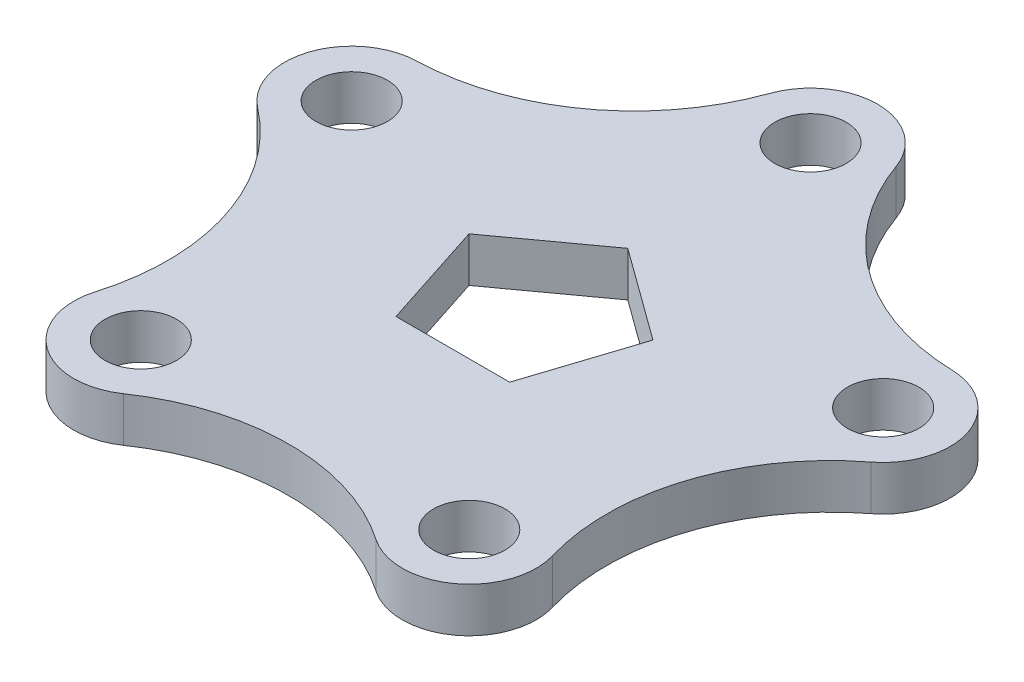
ISO-10303-21;
HEADER;
FILE_DESCRIPTION(('STEP AP214'),'2;1');
FILE_NAME('part.step','',(''),(''),'','','');
FILE_SCHEMA(('AUTOMOTIVE_DESIGN { 1 0 10303 214 1 1 1 1 }'));
ENDSEC;
DATA;
#1=APPLICATION_CONTEXT('core data for automotive mechanical design processes');
#2=APPLICATION_PROTOCOL_DEFINITION('international standard','automotive_design',2000,#1);
#3=PRODUCT_CONTEXT('',#1,'mechanical');
#4=PRODUCT('Part','Part','',(#3));
#5=PRODUCT_RELATED_PRODUCT_CATEGORY('part','',(#4));
#6=PRODUCT_DEFINITION_FORMATION('','',#4);
#7=PRODUCT_DEFINITION_CONTEXT('part definition',#1,'design');
#8=PRODUCT_DEFINITION('design','',#6,#7);
#9=PRODUCT_DEFINITION_SHAPE('','',#8);
#10=(LENGTH_UNIT() NAMED_UNIT(*) SI_UNIT(.MILLI.,.METRE.));
#11=(NAMED_UNIT(*) PLANE_ANGLE_UNIT() SI_UNIT($,.RADIAN.));
#12=(NAMED_UNIT(*) SI_UNIT($,.STERADIAN.) SOLID_ANGLE_UNIT());
#13=UNCERTAINTY_MEASURE_WITH_UNIT(LENGTH_MEASURE(1.E-05),#10,'distance_accuracy_value','');
#14=(GEOMETRIC_REPRESENTATION_CONTEXT(3) GLOBAL_UNCERTAINTY_ASSIGNED_CONTEXT((#13)) GLOBAL_UNIT_ASSIGNED_CONTEXT((#10,
#11,#12)) REPRESENTATION_CONTEXT('',''));
#15=CARTESIAN_POINT('',(0.,0.,0.));
#16=DIRECTION('',(0.,0.,1.));
#17=DIRECTION('',(1.,0.,0.));
#18=AXIS2_PLACEMENT_3D('',#15,#16,#17);
#19=CARTESIAN_POINT('',(10.2862419151183,10.,-14.1577974015616));
#20=DIRECTION('',(-0.587785252292472,0.,0.809016994374948));
#21=DIRECTION('',(0.809016994374948,0.,0.587785252292472));
#22=AXIS2_PLACEMENT_3D('',#19,#20,#21);
#23=PLANE('',#22);
#24=DIRECTION('',(-0.809016994374948,0.,-0.587785252292472));
#25=VECTOR('',#24,1.);
#26=CARTESIAN_POINT('',(10.2862419151183,0.,-14.1577974015616));
#27=LINE('',#26,#25);
#28=CARTESIAN_POINT('',(20.5724838302366,0.,-6.68440519687687));
#29=VERTEX_POINT('',#28);
#30=CARTESIAN_POINT('',(0.,0.,-21.6311896062463));
#31=VERTEX_POINT('',#30);
#32=EDGE_CURVE('E229',#29,#31,#27,.T.);
#33=ORIENTED_EDGE('',*,*,#32,.F.);
#34=DIRECTION('',(0.,-1.,0.));
#35=VECTOR('',#34,1.);
#36=CARTESIAN_POINT('',(20.5724838302366,10.,-6.68440519687687));
#37=LINE('',#36,#35);
#38=CARTESIAN_POINT('',(20.5724838302366,10.,-6.68440519687687));
#39=VERTEX_POINT('',#38);
#40=EDGE_CURVE('E11',#39,#29,#37,.T.);
#41=ORIENTED_EDGE('',*,*,#40,.F.);
#42=DIRECTION('',(-0.809016994374948,0.,-0.587785252292472));
#43=VECTOR('',#42,1.);
#44=CARTESIAN_POINT('',(10.2862419151183,10.,-14.1577974015616));
#45=LINE('',#44,#43);
#46=CARTESIAN_POINT('',(0.,10.,-21.6311896062463));
#47=VERTEX_POINT('',#46);
#48=EDGE_CURVE('E330',#39,#47,#45,.T.);
#49=ORIENTED_EDGE('',*,*,#48,.T.);
#50=DIRECTION('',(0.,-1.,0.));
#51=VECTOR('',#50,1.);
#52=CARTESIAN_POINT('',(0.,10.,-21.6311896062463));
#53=LINE('',#52,#51);
#54=EDGE_CURVE('E62',#47,#31,#53,.T.);
#55=ORIENTED_EDGE('',*,*,#54,.T.);
#56=EDGE_LOOP('',(#33,#41,#49,#55));
#57=FACE_BOUND('',#56,.T.);
#58=ADVANCED_FACE('F43',(#57),#23,.T.);
#59=CARTESIAN_POINT('',(16.6434890351652,10.,5.40779740156156));
#60=DIRECTION('',(-0.951056516295154,0.,-0.309016994374947));
#61=DIRECTION('',(-0.309016994374947,0.,0.951056516295154));
#62=AXIS2_PLACEMENT_3D('',#59,#60,#61);
#63=PLANE('',#62);
#64=DIRECTION('',(0.309016994374947,0.,-0.951056516295154));
#65=VECTOR('',#64,1.);
#66=CARTESIAN_POINT('',(16.6434890351652,0.,5.40779740156156));
#67=LINE('',#66,#65);
#68=CARTESIAN_POINT('',(12.7144942400938,0.,17.5));
#69=VERTEX_POINT('',#68);
#70=EDGE_CURVE('E231',#69,#29,#67,.T.);
#71=ORIENTED_EDGE('',*,*,#70,.F.);
#72=DIRECTION('',(0.,-1.,0.));
#73=VECTOR('',#72,1.);
#74=CARTESIAN_POINT('',(12.7144942400938,10.,17.5));
#75=LINE('',#74,#73);
#76=CARTESIAN_POINT('',(12.7144942400938,10.,17.5));
#77=VERTEX_POINT('',#76);
#78=EDGE_CURVE('E53',#77,#69,#75,.T.);
#79=ORIENTED_EDGE('',*,*,#78,.F.);
#80=DIRECTION('',(0.309016994374947,0.,-0.951056516295154));
#81=VECTOR('',#80,1.);
#82=CARTESIAN_POINT('',(16.6434890351652,10.,5.40779740156156));
#83=LINE('',#82,#81);
#84=EDGE_CURVE('E175',#77,#39,#83,.T.);
#85=ORIENTED_EDGE('',*,*,#84,.T.);
#86=ORIENTED_EDGE('',*,*,#40,.T.);
#87=EDGE_LOOP('',(#71,#79,#85,#86));
#88=FACE_BOUND('',#87,.T.);
#89=ADVANCED_FACE('F333',(#88),#63,.T.);
#90=CARTESIAN_POINT('',(0.,10.,17.5));
#91=DIRECTION('',(0.,0.,-1.));
#92=DIRECTION('',(-1.,0.,0.));
#93=AXIS2_PLACEMENT_3D('',#90,#91,#92);
#94=PLANE('',#93);
#95=DIRECTION('',(1.,0.,0.));
#96=VECTOR('',#95,1.);
#97=CARTESIAN_POINT('',(0.,0.,17.5));
#98=LINE('',#97,#96);
#99=CARTESIAN_POINT('',(-12.7144942400938,0.,17.5));
#100=VERTEX_POINT('',#99);
#101=EDGE_CURVE('E162',#100,#69,#98,.T.);
#102=ORIENTED_EDGE('',*,*,#101,.F.);
#103=DIRECTION('',(0.,-1.,0.));
#104=VECTOR('',#103,1.);
#105=CARTESIAN_POINT('',(-12.7144942400938,10.,17.5));
#106=LINE('',#105,#104);
#107=CARTESIAN_POINT('',(-12.7144942400938,10.,17.5));
#108=VERTEX_POINT('',#107);
#109=EDGE_CURVE('E157',#108,#100,#106,.T.);
#110=ORIENTED_EDGE('',*,*,#109,.F.);
#111=DIRECTION('',(1.,0.,0.));
#112=VECTOR('',#111,1.);
#113=CARTESIAN_POINT('',(0.,10.,17.5));
#114=LINE('',#113,#112);
#115=EDGE_CURVE('E160',#108,#77,#114,.T.);
#116=ORIENTED_EDGE('',*,*,#115,.T.);
#117=ORIENTED_EDGE('',*,*,#78,.T.);
#118=EDGE_LOOP('',(#102,#110,#116,#117));
#119=FACE_BOUND('',#118,.T.);
#120=ADVANCED_FACE('F159',(#119),#94,.T.);
#121=CARTESIAN_POINT('',(-16.6434890351652,10.,5.4077974015616));
#122=DIRECTION('',(0.951056516295153,0.,-0.309016994374948));
#123=DIRECTION('',(-0.309016994374948,0.,-0.951056516295153));
#124=AXIS2_PLACEMENT_3D('',#121,#122,#123);
#125=PLANE('',#124);
#126=DIRECTION('',(0.309016994374948,0.,0.951056516295153));
#127=VECTOR('',#126,1.);
#128=CARTESIAN_POINT('',(-16.6434890351652,0.,5.4077974015616));
#129=LINE('',#128,#127);
#130=CARTESIAN_POINT('',(-20.5724838302366,0.,-6.68440519687681));
#131=VERTEX_POINT('',#130);
#132=EDGE_CURVE('E235',#131,#100,#129,.T.);
#133=ORIENTED_EDGE('',*,*,#132,.F.);
#134=DIRECTION('',(0.,-1.,0.));
#135=VECTOR('',#134,1.);
#136=CARTESIAN_POINT('',(-20.5724838302366,10.,-6.68440519687681));
#137=LINE('',#136,#135);
#138=CARTESIAN_POINT('',(-20.5724838302366,10.,-6.68440519687681));
#139=VERTEX_POINT('',#138);
#140=EDGE_CURVE('E108',#139,#131,#137,.T.);
#141=ORIENTED_EDGE('',*,*,#140,.F.);
#142=DIRECTION('',(0.309016994374948,0.,0.951056516295153));
#143=VECTOR('',#142,1.);
#144=CARTESIAN_POINT('',(-16.6434890351652,10.,5.4077974015616));
#145=LINE('',#144,#143);
#146=EDGE_CURVE('E173',#139,#108,#145,.T.);
#147=ORIENTED_EDGE('',*,*,#146,.T.);
#148=ORIENTED_EDGE('',*,*,#109,.T.);
#149=EDGE_LOOP('',(#133,#141,#147,#148));
#150=FACE_BOUND('',#149,.T.);
#151=ADVANCED_FACE('F177',(#150),#125,.T.);
#152=CARTESIAN_POINT('',(61.2393120472352,10.,-84.2886819239109));
#153=DIRECTION('',(0.,-1.,0.));
#154=DIRECTION('',(0.,0.,-1.));
#155=AXIS2_PLACEMENT_3D('',#152,#153,#154);
#156=CYLINDRICAL_SURFACE('',#155,50.);
#157=CARTESIAN_POINT('',(61.2393120472352,0.,-84.2886819239109));
#158=DIRECTION('',(0.,1.,0.));
#159=DIRECTION('',(0.,0.,1.));
#160=AXIS2_PLACEMENT_3D('',#157,#158,#159);
#161=CIRCLE('',#160,50.);
#162=CARTESIAN_POINT('',(14.1321489339773,0.,-67.5281573670564));
#163=VERTEX_POINT('',#162);
#164=CARTESIAN_POINT('',(59.8560199097073,0.,-34.3078205581616));
#165=VERTEX_POINT('',#164);
#166=EDGE_CURVE('E199',#163,#165,#161,.T.);
#167=ORIENTED_EDGE('',*,*,#166,.F.);
#168=DIRECTION('',(0.,-1.,0.));
#169=VECTOR('',#168,1.);
#170=CARTESIAN_POINT('',(14.1321489339773,10.,-67.5281573670564));
#171=LINE('',#170,#169);
#172=CARTESIAN_POINT('',(14.1321489339773,10.,-67.5281573670564));
#173=VERTEX_POINT('',#172);
#174=EDGE_CURVE('E47',#173,#163,#171,.T.);
#175=ORIENTED_EDGE('',*,*,#174,.F.);
#176=CARTESIAN_POINT('',(61.2393120472352,10.,-84.2886819239109));
#177=DIRECTION('',(0.,1.,0.));
#178=DIRECTION('',(0.,0.,1.));
#179=AXIS2_PLACEMENT_3D('',#176,#177,#178);
#180=CIRCLE('',#179,50.);
#181=CARTESIAN_POINT('',(59.8560199097073,10.,-34.3078205581616));
#182=VERTEX_POINT('',#181);
#183=EDGE_CURVE('E280',#173,#182,#180,.T.);
#184=ORIENTED_EDGE('',*,*,#183,.T.);
#185=DIRECTION('',(0.,-1.,0.));
#186=VECTOR('',#185,1.);
#187=CARTESIAN_POINT('',(59.8560199097073,10.,-34.3078205581616));
#188=LINE('',#187,#186);
#189=EDGE_CURVE('E180',#182,#165,#188,.T.);
#190=ORIENTED_EDGE('',*,*,#189,.T.);
#191=EDGE_LOOP('',(#167,#175,#184,#190));
#192=FACE_BOUND('',#191,.T.);
#193=ADVANCED_FACE('F278',(#192),#156,.F.);
#194=CARTESIAN_POINT('',(0.,10.,-62.5));
#195=DIRECTION('',(0.,-1.,0.));
#196=DIRECTION('',(0.,0.,-1.));
#197=AXIS2_PLACEMENT_3D('',#194,#195,#196);
#198=CYLINDRICAL_SURFACE('',#197,15.);
#199=CARTESIAN_POINT('',(0.,0.,-62.5));
#200=DIRECTION('',(0.,1.,0.));
#201=DIRECTION('',(0.,0.,1.));
#202=AXIS2_PLACEMENT_3D('',#199,#200,#201);
#203=CIRCLE('',#202,15.);
#204=CARTESIAN_POINT('',(-14.1321489339778,0.,-67.5281573670552));
#205=VERTEX_POINT('',#204);
#206=EDGE_CURVE('E202',#163,#205,#203,.T.);
#207=ORIENTED_EDGE('',*,*,#206,.T.);
#208=DIRECTION('',(0.,-1.,0.));
#209=VECTOR('',#208,1.);
#210=CARTESIAN_POINT('',(-14.1321489339778,10.,-67.5281573670552));
#211=LINE('',#210,#209);
#212=CARTESIAN_POINT('',(-14.1321489339778,10.,-67.5281573670552));
#213=VERTEX_POINT('',#212);
#214=EDGE_CURVE('E264',#213,#205,#211,.T.);
#215=ORIENTED_EDGE('',*,*,#214,.F.);
#216=CARTESIAN_POINT('',(0.,10.,-62.5));
#217=DIRECTION('',(0.,1.,0.));
#218=DIRECTION('',(0.,0.,1.));
#219=AXIS2_PLACEMENT_3D('',#216,#217,#218);
#220=CIRCLE('',#219,15.);
#221=EDGE_CURVE('E272',#173,#213,#220,.T.);
#222=ORIENTED_EDGE('',*,*,#221,.F.);
#223=ORIENTED_EDGE('',*,*,#174,.T.);
#224=EDGE_LOOP('',(#207,#215,#222,#223));
#225=FACE_BOUND('',#224,.T.);
#226=ADVANCED_FACE('F271',(#225),#198,.T.);
#227=CARTESIAN_POINT('',(-61.239312047237,10.,-84.2886819239057));
#228=DIRECTION('',(0.,-1.,0.));
#229=DIRECTION('',(0.,0.,-1.));
#230=AXIS2_PLACEMENT_3D('',#227,#228,#229);
#231=CYLINDRICAL_SURFACE('',#230,50.);
#232=CARTESIAN_POINT('',(-61.239312047237,0.,-84.2886819239057));
#233=DIRECTION('',(0.,1.,0.));
#234=DIRECTION('',(0.,0.,1.));
#235=AXIS2_PLACEMENT_3D('',#232,#233,#234);
#236=CIRCLE('',#235,50.);
#237=CARTESIAN_POINT('',(-59.8560199097049,0.,-34.3078205581565));
#238=VERTEX_POINT('',#237);
#239=EDGE_CURVE('E205',#238,#205,#236,.T.);
#240=ORIENTED_EDGE('',*,*,#239,.F.);
#241=DIRECTION('',(0.,-1.,0.));
#242=VECTOR('',#241,1.);
#243=CARTESIAN_POINT('',(-59.8560199097049,10.,-34.3078205581565));
#244=LINE('',#243,#242);
#245=CARTESIAN_POINT('',(-59.8560199097049,10.,-34.3078205581565));
#246=VERTEX_POINT('',#245);
#247=EDGE_CURVE('E263',#246,#238,#244,.T.);
#248=ORIENTED_EDGE('',*,*,#247,.F.);
#249=CARTESIAN_POINT('',(-61.239312047237,10.,-84.2886819239057));
#250=DIRECTION('',(0.,1.,0.));
#251=DIRECTION('',(0.,0.,1.));
#252=AXIS2_PLACEMENT_3D('',#249,#250,#251);
#253=CIRCLE('',#252,50.);
#254=EDGE_CURVE('E314',#246,#213,#253,.T.);
#255=ORIENTED_EDGE('',*,*,#254,.T.);
#256=ORIENTED_EDGE('',*,*,#214,.T.);
#257=EDGE_LOOP('',(#240,#248,#255,#256));
#258=FACE_BOUND('',#257,.T.);
#259=ADVANCED_FACE('F312',(#258),#231,.F.);
#260=CARTESIAN_POINT('',(-59.4410322684453,10.,-19.3135621484317));
#261=DIRECTION('',(0.,-1.,0.));
#262=DIRECTION('',(0.,0.,-1.));
#263=AXIS2_PLACEMENT_3D('',#260,#261,#262);
#264=CYLINDRICAL_SURFACE('',#263,15.);
#265=CARTESIAN_POINT('',(-59.4410322684453,0.,-19.3135621484317));
#266=DIRECTION('',(0.,1.,0.));
#267=DIRECTION('',(0.,0.,1.));
#268=AXIS2_PLACEMENT_3D('',#265,#266,#267);
#269=CIRCLE('',#268,15.);
#270=CARTESIAN_POINT('',(-68.5901682849775,0.,-7.42687589233015));
#271=VERTEX_POINT('',#270);
#272=EDGE_CURVE('E208',#238,#271,#269,.T.);
#273=ORIENTED_EDGE('',*,*,#272,.T.);
#274=DIRECTION('',(0.,-1.,0.));
#275=VECTOR('',#274,1.);
#276=CARTESIAN_POINT('',(-68.5901682849775,10.,-7.42687589233015));
#277=LINE('',#276,#275);
#278=CARTESIAN_POINT('',(-68.5901682849775,10.,-7.42687589233015));
#279=VERTEX_POINT('',#278);
#280=EDGE_CURVE('E260',#279,#271,#277,.T.);
#281=ORIENTED_EDGE('',*,*,#280,.F.);
#282=CARTESIAN_POINT('',(-59.4410322684453,10.,-19.3135621484317));
#283=DIRECTION('',(0.,1.,0.));
#284=DIRECTION('',(0.,0.,1.));
#285=AXIS2_PLACEMENT_3D('',#282,#283,#284);
#286=CIRCLE('',#285,15.);
#287=EDGE_CURVE('E315',#246,#279,#286,.T.);
#288=ORIENTED_EDGE('',*,*,#287,.F.);
#289=ORIENTED_EDGE('',*,*,#247,.T.);
#290=EDGE_LOOP('',(#273,#281,#288,#289));
#291=FACE_BOUND('',#290,.T.);
#292=ADVANCED_FACE('F311',(#291),#264,.T.);
#293=CARTESIAN_POINT('',(-99.0872883400849,10.,32.1954116280083));
#294=DIRECTION('',(0.,-1.,0.));
#295=DIRECTION('',(0.,0.,-1.));
#296=AXIS2_PLACEMENT_3D('',#293,#294,#295);
#297=CYLINDRICAL_SURFACE('',#296,50.);
#298=CARTESIAN_POINT('',(-99.0872883400849,0.,32.1954116280083));
#299=DIRECTION('',(0.,1.,0.));
#300=DIRECTION('',(0.,0.,1.));
#301=AXIS2_PLACEMENT_3D('',#298,#299,#300);
#302=CIRCLE('',#301,50.);
#303=CARTESIAN_POINT('',(-51.1252036694618,0.,46.3247581821833));
#304=VERTEX_POINT('',#303);
#305=EDGE_CURVE('E211',#271,#304,#302,.F.);
#306=ORIENTED_EDGE('',*,*,#305,.T.);
#307=DIRECTION('',(0.,-1.,0.));
#308=VECTOR('',#307,1.);
#309=CARTESIAN_POINT('',(-51.1252036694618,10.,46.3247581821833));
#310=LINE('',#309,#308);
#311=CARTESIAN_POINT('',(-51.1252036694618,10.,46.3247581821833));
#312=VERTEX_POINT('',#311);
#313=EDGE_CURVE('E257',#312,#304,#310,.T.);
#314=ORIENTED_EDGE('',*,*,#313,.F.);
#315=CARTESIAN_POINT('',(-99.0872883400849,10.,32.1954116280083));
#316=DIRECTION('',(0.,1.,0.));
#317=DIRECTION('',(0.,0.,1.));
#318=AXIS2_PLACEMENT_3D('',#315,#316,#317);
#319=CIRCLE('',#318,50.);
#320=EDGE_CURVE('E307',#279,#312,#319,.F.);
#321=ORIENTED_EDGE('',*,*,#320,.F.);
#322=ORIENTED_EDGE('',*,*,#280,.T.);
#323=EDGE_LOOP('',(#306,#314,#321,#322));
#324=FACE_BOUND('',#323,.T.);
#325=ADVANCED_FACE('F305',(#324),#297,.F.);
#326=CARTESIAN_POINT('',(-36.7365782682748,10.,50.5635621484358));
#327=DIRECTION('',(0.,-1.,0.));
#328=DIRECTION('',(0.,0.,-1.));
#329=AXIS2_PLACEMENT_3D('',#326,#327,#328);
#330=CYLINDRICAL_SURFACE('',#329,15.);
#331=CARTESIAN_POINT('',(-36.7365782682748,0.,50.5635621484358));
#332=DIRECTION('',(0.,1.,0.));
#333=DIRECTION('',(0.,0.,1.));
#334=AXIS2_PLACEMENT_3D('',#331,#332,#333);
#335=CIRCLE('',#334,15.);
#336=CARTESIAN_POINT('',(-28.2589063602097,0.,62.938095635368));
#337=VERTEX_POINT('',#336);
#338=EDGE_CURVE('E214',#304,#337,#335,.T.);
#339=ORIENTED_EDGE('',*,*,#338,.T.);
#340=DIRECTION('',(0.,-1.,0.));
#341=VECTOR('',#340,1.);
#342=CARTESIAN_POINT('',(-28.2589063602097,10.,62.938095635368));
#343=LINE('',#342,#341);
#344=CARTESIAN_POINT('',(-28.2589063602097,10.,62.938095635368));
#345=VERTEX_POINT('',#344);
#346=EDGE_CURVE('E254',#345,#337,#343,.T.);
#347=ORIENTED_EDGE('',*,*,#346,.F.);
#348=CARTESIAN_POINT('',(-36.7365782682748,10.,50.5635621484358));
#349=DIRECTION('',(0.,1.,0.));
#350=DIRECTION('',(0.,0.,1.));
#351=AXIS2_PLACEMENT_3D('',#348,#349,#350);
#352=CIRCLE('',#351,15.);
#353=EDGE_CURVE('E302',#312,#345,#352,.T.);
#354=ORIENTED_EDGE('',*,*,#353,.F.);
#355=ORIENTED_EDGE('',*,*,#313,.T.);
#356=EDGE_LOOP('',(#339,#347,#354,#355));
#357=FACE_BOUND('',#356,.T.);
#358=ADVANCED_FACE('F300',(#357),#330,.T.);
#359=CARTESIAN_POINT('',(7.10976416629094E-12,10.,104.186540591808));
#360=DIRECTION('',(0.,-1.,0.));
#361=DIRECTION('',(0.,0.,-1.));
#362=AXIS2_PLACEMENT_3D('',#359,#360,#361);
#363=CYLINDRICAL_SURFACE('',#362,50.);
#364=CARTESIAN_POINT('',(7.10976416629094E-12,0.,104.186540591808));
#365=DIRECTION('',(0.,1.,0.));
#366=DIRECTION('',(0.,0.,1.));
#367=AXIS2_PLACEMENT_3D('',#364,#365,#366);
#368=CIRCLE('',#367,50.);
#369=CARTESIAN_POINT('',(28.2589063602204,0.,62.9380956353655));
#370=VERTEX_POINT('',#369);
#371=EDGE_CURVE('E217',#337,#370,#368,.F.);
#372=ORIENTED_EDGE('',*,*,#371,.T.);
#373=DIRECTION('',(0.,-1.,0.));
#374=VECTOR('',#373,1.);
#375=CARTESIAN_POINT('',(28.2589063602204,10.,62.9380956353655));
#376=LINE('',#375,#374);
#377=CARTESIAN_POINT('',(28.2589063602204,10.,62.9380956353655));
#378=VERTEX_POINT('',#377);
#379=EDGE_CURVE('E251',#378,#370,#376,.T.);
#380=ORIENTED_EDGE('',*,*,#379,.F.);
#381=CARTESIAN_POINT('',(7.10976416629094E-12,10.,104.186540591808));
#382=DIRECTION('',(0.,1.,0.));
#383=DIRECTION('',(0.,0.,1.));
#384=AXIS2_PLACEMENT_3D('',#381,#382,#383);
#385=CIRCLE('',#384,50.);
#386=EDGE_CURVE('E324',#345,#378,#385,.F.);
#387=ORIENTED_EDGE('',*,*,#386,.F.);
#388=ORIENTED_EDGE('',*,*,#346,.T.);
#389=EDGE_LOOP('',(#372,#380,#387,#388));
#390=FACE_BOUND('',#389,.T.);
#391=ADVANCED_FACE('F296',(#390),#363,.F.);
#392=CARTESIAN_POINT('',(36.7365782682844,10.,50.5635621484327));
#393=DIRECTION('',(0.,-1.,0.));
#394=DIRECTION('',(0.,0.,-1.));
#395=AXIS2_PLACEMENT_3D('',#392,#393,#394);
#396=CYLINDRICAL_SURFACE('',#395,15.);
#397=CARTESIAN_POINT('',(36.7365782682844,0.,50.5635621484327));
#398=DIRECTION('',(0.,1.,0.));
#399=DIRECTION('',(0.,0.,1.));
#400=AXIS2_PLACEMENT_3D('',#397,#398,#399);
#401=CIRCLE('',#400,15.);
#402=CARTESIAN_POINT('',(51.125203669471,0.,46.324758182179));
#403=VERTEX_POINT('',#402);
#404=EDGE_CURVE('E220',#370,#403,#401,.T.);
#405=ORIENTED_EDGE('',*,*,#404,.T.);
#406=DIRECTION('',(0.,-1.,0.));
#407=VECTOR('',#406,1.);
#408=CARTESIAN_POINT('',(51.125203669471,10.,46.324758182179));
#409=LINE('',#408,#407);
#410=CARTESIAN_POINT('',(51.125203669471,10.,46.324758182179));
#411=VERTEX_POINT('',#410);
#412=EDGE_CURVE('E248',#411,#403,#409,.T.);
#413=ORIENTED_EDGE('',*,*,#412,.F.);
#414=CARTESIAN_POINT('',(36.7365782682844,10.,50.5635621484327));
#415=DIRECTION('',(0.,1.,0.));
#416=DIRECTION('',(0.,0.,1.));
#417=AXIS2_PLACEMENT_3D('',#414,#415,#416);
#418=CIRCLE('',#417,15.);
#419=EDGE_CURVE('E293',#378,#411,#418,.T.);
#420=ORIENTED_EDGE('',*,*,#419,.F.);
#421=ORIENTED_EDGE('',*,*,#379,.T.);
#422=EDGE_LOOP('',(#405,#413,#420,#421));
#423=FACE_BOUND('',#422,.T.);
#424=ADVANCED_FACE('F291',(#423),#396,.T.);
#425=CARTESIAN_POINT('',(99.0872883400929,10.,32.1954116279999));
#426=DIRECTION('',(0.,-1.,0.));
#427=DIRECTION('',(0.,0.,-1.));
#428=AXIS2_PLACEMENT_3D('',#425,#426,#427);
#429=CYLINDRICAL_SURFACE('',#428,50.);
#430=CARTESIAN_POINT('',(99.0872883400929,0.,32.1954116279999));
#431=DIRECTION('',(0.,1.,0.));
#432=DIRECTION('',(0.,0.,1.));
#433=AXIS2_PLACEMENT_3D('',#430,#431,#432);
#434=CIRCLE('',#433,50.);
#435=CARTESIAN_POINT('',(68.5901682849822,0.,-7.42687589233597));
#436=VERTEX_POINT('',#435);
#437=EDGE_CURVE('E223',#403,#436,#434,.F.);
#438=ORIENTED_EDGE('',*,*,#437,.T.);
#439=DIRECTION('',(0.,-1.,0.));
#440=VECTOR('',#439,1.);
#441=CARTESIAN_POINT('',(68.5901682849822,10.,-7.42687589233597));
#442=LINE('',#441,#440);
#443=CARTESIAN_POINT('',(68.5901682849822,10.,-7.42687589233597));
#444=VERTEX_POINT('',#443);
#445=EDGE_CURVE('E245',#444,#436,#442,.T.);
#446=ORIENTED_EDGE('',*,*,#445,.F.);
#447=CARTESIAN_POINT('',(99.0872883400929,10.,32.1954116279999));
#448=DIRECTION('',(0.,1.,0.));
#449=DIRECTION('',(0.,0.,1.));
#450=AXIS2_PLACEMENT_3D('',#447,#448,#449);
#451=CIRCLE('',#450,50.);
#452=EDGE_CURVE('E288',#411,#444,#451,.F.);
#453=ORIENTED_EDGE('',*,*,#452,.F.);
#454=ORIENTED_EDGE('',*,*,#412,.T.);
#455=EDGE_LOOP('',(#438,#446,#453,#454));
#456=FACE_BOUND('',#455,.T.);
#457=ADVANCED_FACE('F286',(#456),#429,.F.);
#458=CARTESIAN_POINT('',(59.4410322684489,10.,-19.3135621484367));
#459=DIRECTION('',(0.,-1.,0.));
#460=DIRECTION('',(0.,0.,-1.));
#461=AXIS2_PLACEMENT_3D('',#458,#459,#460);
#462=CYLINDRICAL_SURFACE('',#461,15.);
#463=CARTESIAN_POINT('',(59.4410322684489,0.,-19.3135621484367));
#464=DIRECTION('',(0.,1.,0.));
#465=DIRECTION('',(0.,0.,1.));
#466=AXIS2_PLACEMENT_3D('',#463,#464,#465);
#467=CIRCLE('',#466,15.);
#468=EDGE_CURVE('E226',#436,#165,#467,.T.);
#469=ORIENTED_EDGE('',*,*,#468,.T.);
#470=ORIENTED_EDGE('',*,*,#189,.F.);
#471=CARTESIAN_POINT('',(59.4410322684489,10.,-19.3135621484367));
#472=DIRECTION('',(0.,1.,0.));
#473=DIRECTION('',(0.,0.,1.));
#474=AXIS2_PLACEMENT_3D('',#471,#472,#473);
#475=CIRCLE('',#474,15.);
#476=EDGE_CURVE('E328',#444,#182,#475,.T.);
#477=ORIENTED_EDGE('',*,*,#476,.F.);
#478=ORIENTED_EDGE('',*,*,#445,.T.);
#479=EDGE_LOOP('',(#469,#470,#477,#478));
#480=FACE_BOUND('',#479,.T.);
#481=ADVANCED_FACE('F282',(#480),#462,.T.);
#482=CARTESIAN_POINT('',(0.,10.,-62.5));
#483=DIRECTION('',(0.,-1.,0.));
#484=DIRECTION('',(0.,0.,-1.));
#485=AXIS2_PLACEMENT_3D('',#482,#483,#484);
#486=CYLINDRICAL_SURFACE('',#485,8.);
#487=CARTESIAN_POINT('',(0.,10.,-62.5));
#488=DIRECTION('',(0.,1.,0.));
#489=DIRECTION('',(0.,0.,1.));
#490=AXIS2_PLACEMENT_3D('',#487,#488,#489);
#491=CIRCLE('',#490,8.);
#492=CARTESIAN_POINT('',(0.,10.,-54.5));
#493=VERTEX_POINT('',#492);
#494=EDGE_CURVE('E592',#493,#493,#491,.T.);
#495=ORIENTED_EDGE('',*,*,#494,.T.);
#496=EDGE_LOOP('',(#495));
#497=FACE_BOUND('',#496,.T.);
#498=CARTESIAN_POINT('',(0.,0.,-62.5));
#499=DIRECTION('',(0.,1.,0.));
#500=DIRECTION('',(0.,0.,1.));
#501=AXIS2_PLACEMENT_3D('',#498,#499,#500);
#502=CIRCLE('',#501,8.);
#503=CARTESIAN_POINT('',(0.,0.,-54.5));
#504=VERTEX_POINT('',#503);
#505=EDGE_CURVE('E196',#504,#504,#502,.T.);
#506=ORIENTED_EDGE('',*,*,#505,.F.);
#507=EDGE_LOOP('',(#506));
#508=FACE_BOUND('',#507,.T.);
#509=ADVANCED_FACE('F357',(#497,#508),#486,.F.);
#510=CARTESIAN_POINT('',(-59.4410322684453,10.,-19.3135621484317));
#511=DIRECTION('',(0.,-1.,0.));
#512=DIRECTION('',(0.,0.,-1.));
#513=AXIS2_PLACEMENT_3D('',#510,#511,#512);
#514=CYLINDRICAL_SURFACE('',#513,8.);
#515=CARTESIAN_POINT('',(-59.4410322684453,10.,-19.3135621484317));
#516=DIRECTION('',(0.,1.,0.));
#517=DIRECTION('',(0.,0.,1.));
#518=AXIS2_PLACEMENT_3D('',#515,#516,#517);
#519=CIRCLE('',#518,8.);
#520=CARTESIAN_POINT('',(-59.4410322684453,10.,-11.3135621484317));
#521=VERTEX_POINT('',#520);
#522=EDGE_CURVE('E585',#521,#521,#519,.T.);
#523=ORIENTED_EDGE('',*,*,#522,.T.);
#524=EDGE_LOOP('',(#523));
#525=FACE_BOUND('',#524,.T.);
#526=CARTESIAN_POINT('',(-59.4410322684453,0.,-19.3135621484317));
#527=DIRECTION('',(0.,1.,0.));
#528=DIRECTION('',(0.,0.,1.));
#529=AXIS2_PLACEMENT_3D('',#526,#527,#528);
#530=CIRCLE('',#529,8.);
#531=CARTESIAN_POINT('',(-59.4410322684453,0.,-11.3135621484317));
#532=VERTEX_POINT('',#531);
#533=EDGE_CURVE('E193',#532,#532,#530,.T.);
#534=ORIENTED_EDGE('',*,*,#533,.F.);
#535=EDGE_LOOP('',(#534));
#536=FACE_BOUND('',#535,.T.);
#537=ADVANCED_FACE('F378',(#525,#536),#514,.F.);
#538=CARTESIAN_POINT('',(59.4410322684489,10.,-19.3135621484367));
#539=DIRECTION('',(0.,-1.,0.));
#540=DIRECTION('',(0.,0.,-1.));
#541=AXIS2_PLACEMENT_3D('',#538,#539,#540);
#542=CYLINDRICAL_SURFACE('',#541,8.00000000000001);
#543=CARTESIAN_POINT('',(59.4410322684489,10.,-19.3135621484367));
#544=DIRECTION('',(0.,1.,0.));
#545=DIRECTION('',(0.,0.,1.));
#546=AXIS2_PLACEMENT_3D('',#543,#544,#545);
#547=CIRCLE('',#546,8.00000000000001);
#548=CARTESIAN_POINT('',(59.4410322684489,10.,-11.3135621484367));
#549=VERTEX_POINT('',#548);
#550=EDGE_CURVE('E582',#549,#549,#547,.T.);
#551=ORIENTED_EDGE('',*,*,#550,.T.);
#552=EDGE_LOOP('',(#551));
#553=FACE_BOUND('',#552,.T.);
#554=CARTESIAN_POINT('',(59.4410322684489,0.,-19.3135621484367));
#555=DIRECTION('',(0.,1.,0.));
#556=DIRECTION('',(0.,0.,1.));
#557=AXIS2_PLACEMENT_3D('',#554,#555,#556);
#558=CIRCLE('',#557,8.00000000000001);
#559=CARTESIAN_POINT('',(59.4410322684489,0.,-11.3135621484367));
#560=VERTEX_POINT('',#559);
#561=EDGE_CURVE('E190',#560,#560,#558,.T.);
#562=ORIENTED_EDGE('',*,*,#561,.F.);
#563=EDGE_LOOP('',(#562));
#564=FACE_BOUND('',#563,.T.);
#565=ADVANCED_FACE('F382',(#553,#564),#542,.F.);
#566=CARTESIAN_POINT('',(-36.7365782682748,10.,50.5635621484358));
#567=DIRECTION('',(0.,-1.,0.));
#568=DIRECTION('',(0.,0.,-1.));
#569=AXIS2_PLACEMENT_3D('',#566,#567,#568);
#570=CYLINDRICAL_SURFACE('',#569,8.);
#571=CARTESIAN_POINT('',(-36.7365782682748,10.,50.5635621484358));
#572=DIRECTION('',(0.,1.,0.));
#573=DIRECTION('',(0.,0.,1.));
#574=AXIS2_PLACEMENT_3D('',#571,#572,#573);
#575=CIRCLE('',#574,8.);
#576=CARTESIAN_POINT('',(-36.7365782682748,10.,58.5635621484358));
#577=VERTEX_POINT('',#576);
#578=EDGE_CURVE('E393',#577,#577,#575,.T.);
#579=ORIENTED_EDGE('',*,*,#578,.T.);
#580=EDGE_LOOP('',(#579));
#581=FACE_BOUND('',#580,.T.);
#582=CARTESIAN_POINT('',(-36.7365782682748,0.,50.5635621484358));
#583=DIRECTION('',(0.,1.,0.));
#584=DIRECTION('',(0.,0.,1.));
#585=AXIS2_PLACEMENT_3D('',#582,#583,#584);
#586=CIRCLE('',#585,8.);
#587=CARTESIAN_POINT('',(-36.7365782682748,0.,58.5635621484358));
#588=VERTEX_POINT('',#587);
#589=EDGE_CURVE('E187',#588,#588,#586,.T.);
#590=ORIENTED_EDGE('',*,*,#589,.F.);
#591=EDGE_LOOP('',(#590));
#592=FACE_BOUND('',#591,.T.);
#593=ADVANCED_FACE('F343',(#581,#592),#570,.F.);
#594=CARTESIAN_POINT('',(36.7365782682844,10.,50.5635621484327));
#595=DIRECTION('',(0.,-1.,0.));
#596=DIRECTION('',(0.,0.,-1.));
#597=AXIS2_PLACEMENT_3D('',#594,#595,#596);
#598=CYLINDRICAL_SURFACE('',#597,8.);
#599=CARTESIAN_POINT('',(36.7365782682844,10.,50.5635621484327));
#600=DIRECTION('',(0.,1.,0.));
#601=DIRECTION('',(0.,0.,1.));
#602=AXIS2_PLACEMENT_3D('',#599,#600,#601);
#603=CIRCLE('',#602,8.);
#604=CARTESIAN_POINT('',(36.7365782682844,10.,58.5635621484327));
#605=VERTEX_POINT('',#604);
#606=EDGE_CURVE('E240',#605,#605,#603,.T.);
#607=ORIENTED_EDGE('',*,*,#606,.T.);
#608=EDGE_LOOP('',(#607));
#609=FACE_BOUND('',#608,.T.);
#610=CARTESIAN_POINT('',(36.7365782682844,0.,50.5635621484327));
#611=DIRECTION('',(0.,1.,0.));
#612=DIRECTION('',(0.,0.,1.));
#613=AXIS2_PLACEMENT_3D('',#610,#611,#612);
#614=CIRCLE('',#613,8.);
#615=CARTESIAN_POINT('',(36.7365782682844,0.,58.5635621484327));
#616=VERTEX_POINT('',#615);
#617=EDGE_CURVE('E184',#616,#616,#614,.T.);
#618=ORIENTED_EDGE('',*,*,#617,.F.);
#619=EDGE_LOOP('',(#618));
#620=FACE_BOUND('',#619,.T.);
#621=ADVANCED_FACE('F45',(#609,#620),#598,.F.);
#622=CARTESIAN_POINT('',(-10.2862419151183,10.,-14.1577974015616));
#623=DIRECTION('',(0.587785252292474,0.,0.809016994374947));
#624=DIRECTION('',(0.809016994374947,0.,-0.587785252292474));
#625=AXIS2_PLACEMENT_3D('',#622,#623,#624);
#626=PLANE('',#625);
#627=DIRECTION('',(-0.809016994374947,0.,0.587785252292474));
#628=VECTOR('',#627,1.);
#629=CARTESIAN_POINT('',(-10.2862419151183,0.,-14.1577974015616));
#630=LINE('',#629,#628);
#631=EDGE_CURVE('E237',#31,#131,#630,.T.);
#632=ORIENTED_EDGE('',*,*,#631,.F.);
#633=ORIENTED_EDGE('',*,*,#54,.F.);
#634=DIRECTION('',(-0.809016994374947,0.,0.587785252292474));
#635=VECTOR('',#634,1.);
#636=CARTESIAN_POINT('',(-10.2862419151183,10.,-14.1577974015616));
#637=LINE('',#636,#635);
#638=EDGE_CURVE('E178',#47,#139,#637,.T.);
#639=ORIENTED_EDGE('',*,*,#638,.T.);
#640=ORIENTED_EDGE('',*,*,#140,.T.);
#641=EDGE_LOOP('',(#632,#633,#639,#640));
#642=FACE_BOUND('',#641,.T.);
#643=ADVANCED_FACE('F334',(#642),#626,.T.);
#644=CARTESIAN_POINT('',(0.,10.,0.));
#645=DIRECTION('',(0.,1.,0.));
#646=DIRECTION('',(0.,0.,1.));
#647=AXIS2_PLACEMENT_3D('',#644,#645,#646);
#648=PLANE('',#647);
#649=ORIENTED_EDGE('',*,*,#606,.F.);
#650=EDGE_LOOP('',(#649));
#651=FACE_BOUND('',#650,.T.);
#652=ORIENTED_EDGE('',*,*,#578,.F.);
#653=EDGE_LOOP('',(#652));
#654=FACE_BOUND('',#653,.T.);
#655=ORIENTED_EDGE('',*,*,#550,.F.);
#656=EDGE_LOOP('',(#655));
#657=FACE_BOUND('',#656,.T.);
#658=ORIENTED_EDGE('',*,*,#522,.F.);
#659=EDGE_LOOP('',(#658));
#660=FACE_BOUND('',#659,.T.);
#661=ORIENTED_EDGE('',*,*,#494,.F.);
#662=EDGE_LOOP('',(#661));
#663=FACE_BOUND('',#662,.T.);
#664=ORIENTED_EDGE('',*,*,#183,.F.);
#665=ORIENTED_EDGE('',*,*,#221,.T.);
#666=ORIENTED_EDGE('',*,*,#254,.F.);
#667=ORIENTED_EDGE('',*,*,#287,.T.);
#668=ORIENTED_EDGE('',*,*,#320,.T.);
#669=ORIENTED_EDGE('',*,*,#353,.T.);
#670=ORIENTED_EDGE('',*,*,#386,.T.);
#671=ORIENTED_EDGE('',*,*,#419,.T.);
#672=ORIENTED_EDGE('',*,*,#452,.T.);
#673=ORIENTED_EDGE('',*,*,#476,.T.);
#674=EDGE_LOOP('',(#664,#665,#666,#667,#668,#669,#670,#671,#672,#673));
#675=FACE_BOUND('',#674,.T.);
#676=ORIENTED_EDGE('',*,*,#48,.F.);
#677=ORIENTED_EDGE('',*,*,#84,.F.);
#678=ORIENTED_EDGE('',*,*,#115,.F.);
#679=ORIENTED_EDGE('',*,*,#146,.F.);
#680=ORIENTED_EDGE('',*,*,#638,.F.);
#681=EDGE_LOOP('',(#676,#677,#678,#679,#680));
#682=FACE_BOUND('',#681,.T.);
#683=ADVANCED_FACE('F171',(#651,#654,#657,#660,#663,#675,#682),#648,.T.);
#684=CARTESIAN_POINT('',(0.,0.,0.));
#685=DIRECTION('',(0.,1.,0.));
#686=DIRECTION('',(0.,0.,1.));
#687=AXIS2_PLACEMENT_3D('',#684,#685,#686);
#688=PLANE('',#687);
#689=ORIENTED_EDGE('',*,*,#617,.T.);
#690=EDGE_LOOP('',(#689));
#691=FACE_BOUND('',#690,.T.);
#692=ORIENTED_EDGE('',*,*,#589,.T.);
#693=EDGE_LOOP('',(#692));
#694=FACE_BOUND('',#693,.T.);
#695=ORIENTED_EDGE('',*,*,#561,.T.);
#696=EDGE_LOOP('',(#695));
#697=FACE_BOUND('',#696,.T.);
#698=ORIENTED_EDGE('',*,*,#533,.T.);
#699=EDGE_LOOP('',(#698));
#700=FACE_BOUND('',#699,.T.);
#701=ORIENTED_EDGE('',*,*,#505,.T.);
#702=EDGE_LOOP('',(#701));
#703=FACE_BOUND('',#702,.T.);
#704=ORIENTED_EDGE('',*,*,#166,.T.);
#705=ORIENTED_EDGE('',*,*,#468,.F.);
#706=ORIENTED_EDGE('',*,*,#437,.F.);
#707=ORIENTED_EDGE('',*,*,#404,.F.);
#708=ORIENTED_EDGE('',*,*,#371,.F.);
#709=ORIENTED_EDGE('',*,*,#338,.F.);
#710=ORIENTED_EDGE('',*,*,#305,.F.);
#711=ORIENTED_EDGE('',*,*,#272,.F.);
#712=ORIENTED_EDGE('',*,*,#239,.T.);
#713=ORIENTED_EDGE('',*,*,#206,.F.);
#714=EDGE_LOOP('',(#704,#705,#706,#707,#708,#709,#710,#711,#712,#713));
#715=FACE_BOUND('',#714,.T.);
#716=ORIENTED_EDGE('',*,*,#32,.T.);
#717=ORIENTED_EDGE('',*,*,#631,.T.);
#718=ORIENTED_EDGE('',*,*,#132,.T.);
#719=ORIENTED_EDGE('',*,*,#101,.T.);
#720=ORIENTED_EDGE('',*,*,#70,.T.);
#721=EDGE_LOOP('',(#716,#717,#718,#719,#720));
#722=FACE_BOUND('',#721,.T.);
#723=ADVANCED_FACE('F275',(#691,#694,#697,#700,#703,#715,#722),#688,.F.);
#724=CLOSED_SHELL('',(#58,#89,#120,#151,#193,#226,#259,#292,#325,#358,#391,#424,#457,#481,#509,
#537,#565,#593,#621,#643,#683,#723));
#725=MANIFOLD_SOLID_BREP('B2',#724);
#726=ADVANCED_BREP_SHAPE_REPRESENTATION('',(#18,#725),#14);
#727=SHAPE_DEFINITION_REPRESENTATION(#9,#726);
ENDSEC;
END-ISO-10303-21;
